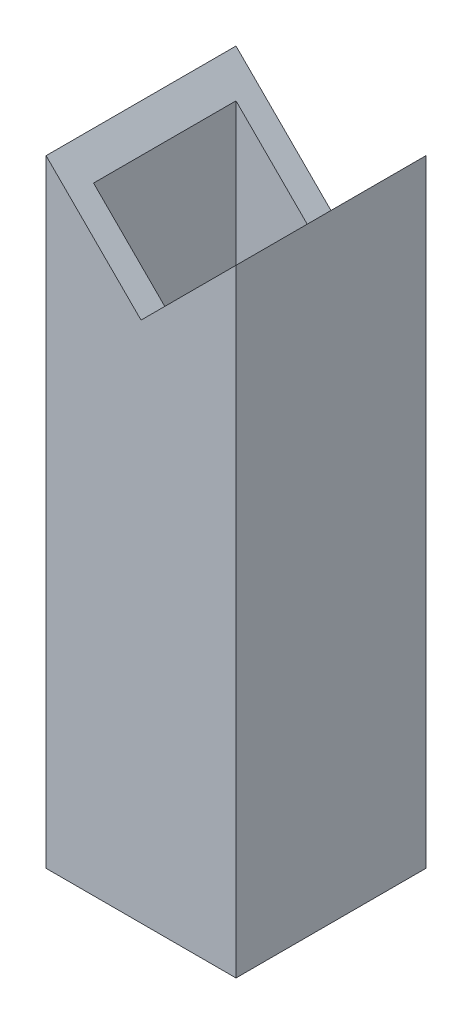
ISO-10303-21;
HEADER;
FILE_DESCRIPTION(('STEP AP214'),'2;1');
FILE_NAME('part.step','',(''),(''),'','','');
FILE_SCHEMA(('AUTOMOTIVE_DESIGN { 1 0 10303 214 1 1 1 1 }'));
ENDSEC;
DATA;
#1=APPLICATION_CONTEXT('core data for automotive mechanical design processes');
#2=APPLICATION_PROTOCOL_DEFINITION('international standard','automotive_design',2000,#1);
#3=PRODUCT_CONTEXT('',#1,'mechanical');
#4=PRODUCT('Part','Part','',(#3));
#5=PRODUCT_RELATED_PRODUCT_CATEGORY('part','',(#4));
#6=PRODUCT_DEFINITION_FORMATION('','',#4);
#7=PRODUCT_DEFINITION_CONTEXT('part definition',#1,'design');
#8=PRODUCT_DEFINITION('design','',#6,#7);
#9=PRODUCT_DEFINITION_SHAPE('','',#8);
#10=(LENGTH_UNIT() NAMED_UNIT(*) SI_UNIT(.MILLI.,.METRE.));
#11=(NAMED_UNIT(*) PLANE_ANGLE_UNIT() SI_UNIT($,.RADIAN.));
#12=(NAMED_UNIT(*) SI_UNIT($,.STERADIAN.) SOLID_ANGLE_UNIT());
#13=UNCERTAINTY_MEASURE_WITH_UNIT(LENGTH_MEASURE(1.E-05),#10,'distance_accuracy_value','');
#14=(GEOMETRIC_REPRESENTATION_CONTEXT(3) GLOBAL_UNCERTAINTY_ASSIGNED_CONTEXT((#13)) GLOBAL_UNIT_ASSIGNED_CONTEXT((#10,
#11,#12)) REPRESENTATION_CONTEXT('',''));
#15=CARTESIAN_POINT('',(0.,0.,0.));
#16=DIRECTION('',(0.,0.,1.));
#17=DIRECTION('',(1.,0.,0.));
#18=AXIS2_PLACEMENT_3D('',#15,#16,#17);
#19=CARTESIAN_POINT('',(-25.4,82.55,-25.4));
#20=DIRECTION('',(0.,0.,1.));
#21=DIRECTION('',(1.,0.,0.));
#22=AXIS2_PLACEMENT_3D('',#19,#20,#21);
#23=PLANE('',#22);
#24=DIRECTION('',(-0.707106781186548,0.707106781186547,0.));
#25=VECTOR('',#24,1.);
#26=CARTESIAN_POINT('',(-25.4,82.55,-25.4));
#27=LINE('',#26,#25);
#28=CARTESIAN_POINT('',(0.,57.1499999999999,-25.4));
#29=VERTEX_POINT('',#28);
#30=CARTESIAN_POINT('',(-25.4,82.55,-25.4));
#31=VERTEX_POINT('',#30);
#32=EDGE_CURVE('E48',#29,#31,#27,.T.);
#33=ORIENTED_EDGE('',*,*,#32,.F.);
#34=DIRECTION('',(-0.707106781186546,-0.707106781186549,0.));
#35=VECTOR('',#34,1.);
#36=CARTESIAN_POINT('',(1.07552855510562E-13,57.15,-25.4));
#37=LINE('',#36,#35);
#38=CARTESIAN_POINT('',(25.4,82.55,-25.4));
#39=VERTEX_POINT('',#38);
#40=EDGE_CURVE('E170',#39,#29,#37,.T.);
#41=ORIENTED_EDGE('',*,*,#40,.F.);
#42=DIRECTION('',(0.,-1.,0.));
#43=VECTOR('',#42,1.);
#44=CARTESIAN_POINT('',(25.4,82.55,-25.4));
#45=LINE('',#44,#43);
#46=CARTESIAN_POINT('',(25.4,-82.55,-25.4));
#47=VERTEX_POINT('',#46);
#48=EDGE_CURVE('E119',#39,#47,#45,.T.);
#49=ORIENTED_EDGE('',*,*,#48,.T.);
#50=DIRECTION('',(-1.,0.,0.));
#51=VECTOR('',#50,1.);
#52=CARTESIAN_POINT('',(-25.4,-82.55,-25.4));
#53=LINE('',#52,#51);
#54=CARTESIAN_POINT('',(-25.4,-82.55,-25.4));
#55=VERTEX_POINT('',#54);
#56=EDGE_CURVE('E155',#47,#55,#53,.T.);
#57=ORIENTED_EDGE('',*,*,#56,.T.);
#58=DIRECTION('',(0.,-1.,0.));
#59=VECTOR('',#58,1.);
#60=CARTESIAN_POINT('',(-25.4,82.55,-25.4));
#61=LINE('',#60,#59);
#62=EDGE_CURVE('E165',#31,#55,#61,.T.);
#63=ORIENTED_EDGE('',*,*,#62,.F.);
#64=EDGE_LOOP('',(#33,#41,#49,#57,#63));
#65=FACE_BOUND('',#64,.T.);
#66=ADVANCED_FACE('F33',(#65),#23,.F.);
#67=CARTESIAN_POINT('',(-25.4,82.55,25.4));
#68=DIRECTION('',(0.,0.,-1.));
#69=DIRECTION('',(-1.,0.,0.));
#70=AXIS2_PLACEMENT_3D('',#67,#68,#69);
#71=PLANE('',#70);
#72=DIRECTION('',(0.707106781186548,-0.707106781186547,0.));
#73=VECTOR('',#72,1.);
#74=CARTESIAN_POINT('',(-25.4,82.55,25.4));
#75=LINE('',#74,#73);
#76=CARTESIAN_POINT('',(-25.4,82.55,25.4));
#77=VERTEX_POINT('',#76);
#78=CARTESIAN_POINT('',(0.,57.1499999999999,25.4));
#79=VERTEX_POINT('',#78);
#80=EDGE_CURVE('E125',#77,#79,#75,.T.);
#81=ORIENTED_EDGE('',*,*,#80,.F.);
#82=DIRECTION('',(0.,-1.,0.));
#83=VECTOR('',#82,1.);
#84=CARTESIAN_POINT('',(-25.4,82.55,25.4));
#85=LINE('',#84,#83);
#86=CARTESIAN_POINT('',(-25.4,-82.55,25.4));
#87=VERTEX_POINT('',#86);
#88=EDGE_CURVE('E162',#77,#87,#85,.T.);
#89=ORIENTED_EDGE('',*,*,#88,.T.);
#90=DIRECTION('',(1.,0.,0.));
#91=VECTOR('',#90,1.);
#92=CARTESIAN_POINT('',(-25.4,-82.55,25.4));
#93=LINE('',#92,#91);
#94=CARTESIAN_POINT('',(25.4,-82.55,25.4));
#95=VERTEX_POINT('',#94);
#96=EDGE_CURVE('E150',#87,#95,#93,.T.);
#97=ORIENTED_EDGE('',*,*,#96,.T.);
#98=DIRECTION('',(0.,-1.,0.));
#99=VECTOR('',#98,1.);
#100=CARTESIAN_POINT('',(25.4,82.55,25.4));
#101=LINE('',#100,#99);
#102=CARTESIAN_POINT('',(25.4,82.55,25.4));
#103=VERTEX_POINT('',#102);
#104=EDGE_CURVE('E152',#103,#95,#101,.T.);
#105=ORIENTED_EDGE('',*,*,#104,.F.);
#106=DIRECTION('',(0.707106781186546,0.707106781186549,0.));
#107=VECTOR('',#106,1.);
#108=CARTESIAN_POINT('',(1.07552855510562E-13,57.15,25.4));
#109=LINE('',#108,#107);
#110=EDGE_CURVE('E56',#79,#103,#109,.T.);
#111=ORIENTED_EDGE('',*,*,#110,.F.);
#112=EDGE_LOOP('',(#81,#89,#97,#105,#111));
#113=FACE_BOUND('',#112,.T.);
#114=ADVANCED_FACE('F182',(#113),#71,.F.);
#115=CARTESIAN_POINT('',(19.05,82.55,19.05));
#116=DIRECTION('',(-1.,0.,0.));
#117=DIRECTION('',(0.,0.,1.));
#118=AXIS2_PLACEMENT_3D('',#115,#116,#117);
#119=PLANE('',#118);
#120=DIRECTION('',(0.,-1.,0.));
#121=VECTOR('',#120,1.);
#122=CARTESIAN_POINT('',(19.05,82.55,19.05));
#123=LINE('',#122,#121);
#124=CARTESIAN_POINT('',(19.05,76.2,19.05));
#125=VERTEX_POINT('',#124);
#126=CARTESIAN_POINT('',(19.05,-82.55,19.05));
#127=VERTEX_POINT('',#126);
#128=EDGE_CURVE('E138',#125,#127,#123,.T.);
#129=ORIENTED_EDGE('',*,*,#128,.F.);
#130=DIRECTION('',(0.,0.,-1.));
#131=VECTOR('',#130,1.);
#132=CARTESIAN_POINT('',(19.05,76.2,19.05));
#133=LINE('',#132,#131);
#134=CARTESIAN_POINT('',(19.05,76.2,-19.05));
#135=VERTEX_POINT('',#134);
#136=EDGE_CURVE('E116',#125,#135,#133,.T.);
#137=ORIENTED_EDGE('',*,*,#136,.T.);
#138=DIRECTION('',(0.,-1.,0.));
#139=VECTOR('',#138,1.);
#140=CARTESIAN_POINT('',(19.05,82.55,-19.05));
#141=LINE('',#140,#139);
#142=CARTESIAN_POINT('',(19.05,-82.55,-19.05));
#143=VERTEX_POINT('',#142);
#144=EDGE_CURVE('E140',#135,#143,#141,.T.);
#145=ORIENTED_EDGE('',*,*,#144,.T.);
#146=DIRECTION('',(0.,0.,-1.));
#147=VECTOR('',#146,1.);
#148=CARTESIAN_POINT('',(19.05,-82.55,19.05));
#149=LINE('',#148,#147);
#150=EDGE_CURVE('E185',#127,#143,#149,.T.);
#151=ORIENTED_EDGE('',*,*,#150,.F.);
#152=EDGE_LOOP('',(#129,#137,#145,#151));
#153=FACE_BOUND('',#152,.T.);
#154=ADVANCED_FACE('F213',(#153),#119,.T.);
#155=CARTESIAN_POINT('',(-19.05,82.55,-19.05));
#156=DIRECTION('',(0.,0.,1.));
#157=DIRECTION('',(1.,0.,0.));
#158=AXIS2_PLACEMENT_3D('',#155,#156,#157);
#159=PLANE('',#158);
#160=DIRECTION('',(-0.707106781186546,-0.707106781186549,0.));
#161=VECTOR('',#160,1.);
#162=CARTESIAN_POINT('',(3.1750000000001,60.325,-19.05));
#163=LINE('',#162,#161);
#164=CARTESIAN_POINT('',(0.,57.1499999999999,-19.05));
#165=VERTEX_POINT('',#164);
#166=EDGE_CURVE('E206',#135,#165,#163,.T.);
#167=ORIENTED_EDGE('',*,*,#166,.T.);
#168=DIRECTION('',(-0.707106781186548,0.707106781186547,0.));
#169=VECTOR('',#168,1.);
#170=CARTESIAN_POINT('',(-22.225,79.375,-19.05));
#171=LINE('',#170,#169);
#172=CARTESIAN_POINT('',(-19.05,76.2,-19.05));
#173=VERTEX_POINT('',#172);
#174=EDGE_CURVE('E183',#165,#173,#171,.T.);
#175=ORIENTED_EDGE('',*,*,#174,.T.);
#176=DIRECTION('',(0.,-1.,0.));
#177=VECTOR('',#176,1.);
#178=CARTESIAN_POINT('',(-19.05,82.55,-19.05));
#179=LINE('',#178,#177);
#180=CARTESIAN_POINT('',(-19.05,-82.55,-19.05));
#181=VERTEX_POINT('',#180);
#182=EDGE_CURVE('E137',#173,#181,#179,.T.);
#183=ORIENTED_EDGE('',*,*,#182,.T.);
#184=DIRECTION('',(-1.,0.,0.));
#185=VECTOR('',#184,1.);
#186=CARTESIAN_POINT('',(-19.05,-82.55,-19.05));
#187=LINE('',#186,#185);
#188=EDGE_CURVE('E194',#143,#181,#187,.T.);
#189=ORIENTED_EDGE('',*,*,#188,.F.);
#190=ORIENTED_EDGE('',*,*,#144,.F.);
#191=EDGE_LOOP('',(#167,#175,#183,#189,#190));
#192=FACE_BOUND('',#191,.T.);
#193=ADVANCED_FACE('F204',(#192),#159,.T.);
#194=CARTESIAN_POINT('',(-19.05,82.55,19.05));
#195=DIRECTION('',(1.,0.,0.));
#196=DIRECTION('',(0.,0.,-1.));
#197=AXIS2_PLACEMENT_3D('',#194,#195,#196);
#198=PLANE('',#197);
#199=ORIENTED_EDGE('',*,*,#182,.F.);
#200=DIRECTION('',(0.,0.,1.));
#201=VECTOR('',#200,1.);
#202=CARTESIAN_POINT('',(-19.05,76.2,19.05));
#203=LINE('',#202,#201);
#204=CARTESIAN_POINT('',(-19.05,76.2,19.05));
#205=VERTEX_POINT('',#204);
#206=EDGE_CURVE('E188',#173,#205,#203,.T.);
#207=ORIENTED_EDGE('',*,*,#206,.T.);
#208=DIRECTION('',(0.,-1.,0.));
#209=VECTOR('',#208,1.);
#210=CARTESIAN_POINT('',(-19.05,82.55,19.05));
#211=LINE('',#210,#209);
#212=CARTESIAN_POINT('',(-19.05,-82.55,19.05));
#213=VERTEX_POINT('',#212);
#214=EDGE_CURVE('E131',#205,#213,#211,.T.);
#215=ORIENTED_EDGE('',*,*,#214,.T.);
#216=DIRECTION('',(0.,0.,1.));
#217=VECTOR('',#216,1.);
#218=CARTESIAN_POINT('',(-19.05,-82.55,19.05));
#219=LINE('',#218,#217);
#220=EDGE_CURVE('E197',#181,#213,#219,.T.);
#221=ORIENTED_EDGE('',*,*,#220,.F.);
#222=EDGE_LOOP('',(#199,#207,#215,#221));
#223=FACE_BOUND('',#222,.T.);
#224=ADVANCED_FACE('F201',(#223),#198,.T.);
#225=CARTESIAN_POINT('',(-19.05,82.55,19.05));
#226=DIRECTION('',(0.,0.,-1.));
#227=DIRECTION('',(-1.,0.,0.));
#228=AXIS2_PLACEMENT_3D('',#225,#226,#227);
#229=PLANE('',#228);
#230=ORIENTED_EDGE('',*,*,#214,.F.);
#231=DIRECTION('',(0.707106781186548,-0.707106781186547,0.));
#232=VECTOR('',#231,1.);
#233=CARTESIAN_POINT('',(-22.225,79.375,19.05));
#234=LINE('',#233,#232);
#235=CARTESIAN_POINT('',(0.,57.1499999999999,19.05));
#236=VERTEX_POINT('',#235);
#237=EDGE_CURVE('E11',#205,#236,#234,.T.);
#238=ORIENTED_EDGE('',*,*,#237,.T.);
#239=DIRECTION('',(0.707106781186546,0.707106781186549,0.));
#240=VECTOR('',#239,1.);
#241=CARTESIAN_POINT('',(3.1750000000001,60.325,19.05));
#242=LINE('',#241,#240);
#243=EDGE_CURVE('E41',#236,#125,#242,.T.);
#244=ORIENTED_EDGE('',*,*,#243,.T.);
#245=ORIENTED_EDGE('',*,*,#128,.T.);
#246=DIRECTION('',(1.,0.,0.));
#247=VECTOR('',#246,1.);
#248=CARTESIAN_POINT('',(-19.05,-82.55,19.05));
#249=LINE('',#248,#247);
#250=EDGE_CURVE('E133',#213,#127,#249,.T.);
#251=ORIENTED_EDGE('',*,*,#250,.F.);
#252=EDGE_LOOP('',(#230,#238,#244,#245,#251));
#253=FACE_BOUND('',#252,.T.);
#254=ADVANCED_FACE('F129',(#253),#229,.T.);
#255=CARTESIAN_POINT('',(25.4,-82.55,-25.4));
#256=DIRECTION('',(0.,-1.,0.));
#257=DIRECTION('',(0.,0.,-1.));
#258=AXIS2_PLACEMENT_3D('',#255,#256,#257);
#259=PLANE('',#258);
#260=DIRECTION('',(0.,0.,-1.));
#261=VECTOR('',#260,1.);
#262=CARTESIAN_POINT('',(25.4,-82.55,25.4));
#263=LINE('',#262,#261);
#264=EDGE_CURVE('E146',#95,#47,#263,.T.);
#265=ORIENTED_EDGE('',*,*,#264,.F.);
#266=ORIENTED_EDGE('',*,*,#96,.F.);
#267=DIRECTION('',(0.,0.,1.));
#268=VECTOR('',#267,1.);
#269=CARTESIAN_POINT('',(-25.4,-82.55,25.4));
#270=LINE('',#269,#268);
#271=EDGE_CURVE('E157',#55,#87,#270,.T.);
#272=ORIENTED_EDGE('',*,*,#271,.F.);
#273=ORIENTED_EDGE('',*,*,#56,.F.);
#274=EDGE_LOOP('',(#265,#266,#272,#273));
#275=FACE_BOUND('',#274,.T.);
#276=ORIENTED_EDGE('',*,*,#250,.T.);
#277=ORIENTED_EDGE('',*,*,#150,.T.);
#278=ORIENTED_EDGE('',*,*,#188,.T.);
#279=ORIENTED_EDGE('',*,*,#220,.T.);
#280=EDGE_LOOP('',(#276,#277,#278,#279));
#281=FACE_BOUND('',#280,.T.);
#282=ADVANCED_FACE('F175',(#275,#281),#259,.T.);
#283=CARTESIAN_POINT('',(25.4,82.55,25.4));
#284=DIRECTION('',(-1.,0.,0.));
#285=DIRECTION('',(0.,0.,1.));
#286=AXIS2_PLACEMENT_3D('',#283,#284,#285);
#287=PLANE('',#286);
#288=ORIENTED_EDGE('',*,*,#264,.T.);
#289=ORIENTED_EDGE('',*,*,#48,.F.);
#290=DIRECTION('',(0.,0.,-1.));
#291=VECTOR('',#290,1.);
#292=CARTESIAN_POINT('',(25.4,82.55,25.4));
#293=LINE('',#292,#291);
#294=EDGE_CURVE('E147',#103,#39,#293,.T.);
#295=ORIENTED_EDGE('',*,*,#294,.F.);
#296=ORIENTED_EDGE('',*,*,#104,.T.);
#297=EDGE_LOOP('',(#288,#289,#295,#296));
#298=FACE_BOUND('',#297,.T.);
#299=ADVANCED_FACE('F35',(#298),#287,.F.);
#300=CARTESIAN_POINT('',(-25.4,82.55,25.4));
#301=DIRECTION('',(1.,0.,0.));
#302=DIRECTION('',(0.,0.,-1.));
#303=AXIS2_PLACEMENT_3D('',#300,#301,#302);
#304=PLANE('',#303);
#305=ORIENTED_EDGE('',*,*,#271,.T.);
#306=ORIENTED_EDGE('',*,*,#88,.F.);
#307=DIRECTION('',(0.,0.,1.));
#308=VECTOR('',#307,1.);
#309=CARTESIAN_POINT('',(-25.4,82.55,25.4));
#310=LINE('',#309,#308);
#311=EDGE_CURVE('E149',#31,#77,#310,.T.);
#312=ORIENTED_EDGE('',*,*,#311,.F.);
#313=ORIENTED_EDGE('',*,*,#62,.T.);
#314=EDGE_LOOP('',(#305,#306,#312,#313));
#315=FACE_BOUND('',#314,.T.);
#316=ADVANCED_FACE('F180',(#315),#304,.F.);
#317=CARTESIAN_POINT('',(-25.4,82.55,313.96696920028));
#318=DIRECTION('',(0.707106781186547,0.707106781186548,0.));
#319=DIRECTION('',(-0.707106781186548,0.707106781186547,0.));
#320=AXIS2_PLACEMENT_3D('',#317,#318,#319);
#321=PLANE('',#320);
#322=DIRECTION('',(0.,0.,-1.));
#323=VECTOR('',#322,1.);
#324=CARTESIAN_POINT('',(0.,57.1499999999999,313.96696920028));
#325=LINE('',#324,#323);
#326=EDGE_CURVE('E126',#165,#29,#325,.T.);
#327=ORIENTED_EDGE('',*,*,#326,.T.);
#328=ORIENTED_EDGE('',*,*,#32,.T.);
#329=ORIENTED_EDGE('',*,*,#311,.T.);
#330=ORIENTED_EDGE('',*,*,#80,.T.);
#331=EDGE_CURVE('E114',#79,#236,#325,.T.);
#332=ORIENTED_EDGE('',*,*,#331,.T.);
#333=ORIENTED_EDGE('',*,*,#237,.F.);
#334=ORIENTED_EDGE('',*,*,#206,.F.);
#335=ORIENTED_EDGE('',*,*,#174,.F.);
#336=EDGE_LOOP('',(#327,#328,#329,#330,#332,#333,#334,#335));
#337=FACE_BOUND('',#336,.T.);
#338=ADVANCED_FACE('F122',(#337),#321,.T.);
#339=CARTESIAN_POINT('',(0.,57.1499999999999,313.96696920028));
#340=DIRECTION('',(-0.707106781186549,0.707106781186546,0.));
#341=DIRECTION('',(-0.707106781186546,-0.707106781186549,0.));
#342=AXIS2_PLACEMENT_3D('',#339,#340,#341);
#343=PLANE('',#342);
#344=ORIENTED_EDGE('',*,*,#294,.T.);
#345=ORIENTED_EDGE('',*,*,#40,.T.);
#346=ORIENTED_EDGE('',*,*,#326,.F.);
#347=ORIENTED_EDGE('',*,*,#166,.F.);
#348=ORIENTED_EDGE('',*,*,#136,.F.);
#349=ORIENTED_EDGE('',*,*,#243,.F.);
#350=ORIENTED_EDGE('',*,*,#331,.F.);
#351=ORIENTED_EDGE('',*,*,#110,.T.);
#352=EDGE_LOOP('',(#344,#345,#346,#347,#348,#349,#350,#351));
#353=FACE_BOUND('',#352,.T.);
#354=ADVANCED_FACE('F113',(#353),#343,.T.);
#355=CLOSED_SHELL('',(#66,#114,#154,#193,#224,#254,#282,#299,#316,#338,#354));
#356=MANIFOLD_SOLID_BREP('B2',#355);
#357=ADVANCED_BREP_SHAPE_REPRESENTATION('',(#18,#356),#14);
#358=SHAPE_DEFINITION_REPRESENTATION(#9,#357);
ENDSEC;
END-ISO-10303-21;
